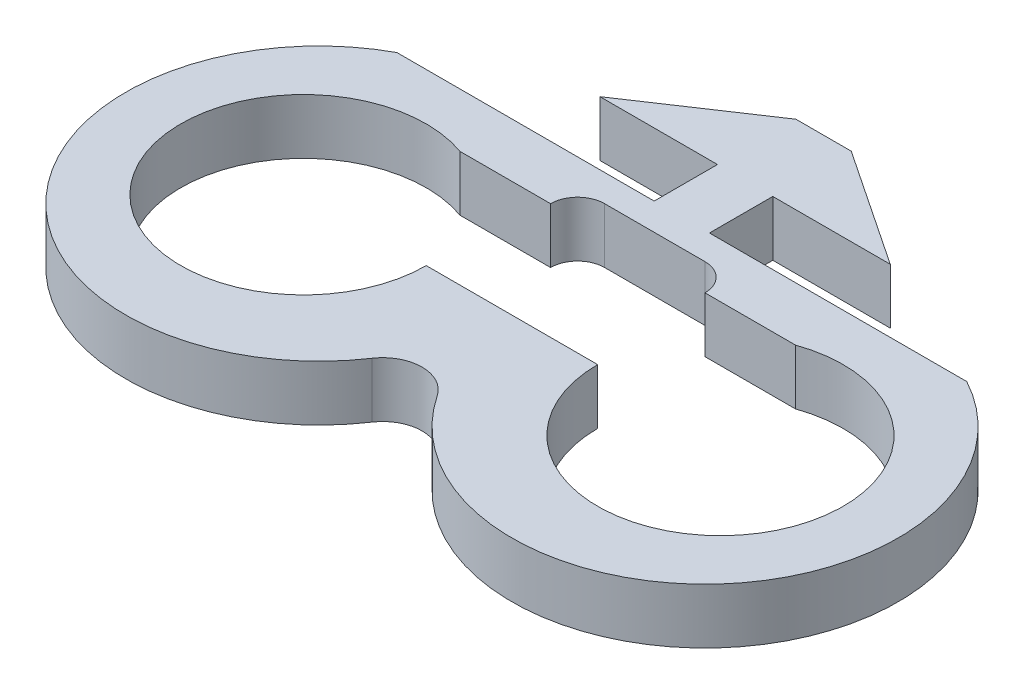
ISO-10303-21;
HEADER;
FILE_DESCRIPTION(('STEP AP214'),'2;1');
FILE_NAME('part.step','',(''),(''),'','','');
FILE_SCHEMA(('AUTOMOTIVE_DESIGN { 1 0 10303 214 1 1 1 1 }'));
ENDSEC;
DATA;
#1=APPLICATION_CONTEXT('core data for automotive mechanical design processes');
#2=APPLICATION_PROTOCOL_DEFINITION('international standard','automotive_design',2000,#1);
#3=PRODUCT_CONTEXT('',#1,'mechanical');
#4=PRODUCT('Part','Part','',(#3));
#5=PRODUCT_RELATED_PRODUCT_CATEGORY('part','',(#4));
#6=PRODUCT_DEFINITION_FORMATION('','',#4);
#7=PRODUCT_DEFINITION_CONTEXT('part definition',#1,'design');
#8=PRODUCT_DEFINITION('design','',#6,#7);
#9=PRODUCT_DEFINITION_SHAPE('','',#8);
#10=(LENGTH_UNIT() NAMED_UNIT(*) SI_UNIT(.MILLI.,.METRE.));
#11=(NAMED_UNIT(*) PLANE_ANGLE_UNIT() SI_UNIT($,.RADIAN.));
#12=(NAMED_UNIT(*) SI_UNIT($,.STERADIAN.) SOLID_ANGLE_UNIT());
#13=UNCERTAINTY_MEASURE_WITH_UNIT(LENGTH_MEASURE(1.E-05),#10,'distance_accuracy_value','');
#14=(GEOMETRIC_REPRESENTATION_CONTEXT(3) GLOBAL_UNCERTAINTY_ASSIGNED_CONTEXT((#13)) GLOBAL_UNIT_ASSIGNED_CONTEXT((#10,
#11,#12)) REPRESENTATION_CONTEXT('',''));
#15=CARTESIAN_POINT('',(0.,0.,0.));
#16=DIRECTION('',(0.,0.,1.));
#17=DIRECTION('',(1.,0.,0.));
#18=AXIS2_PLACEMENT_3D('',#15,#16,#17);
#19=CARTESIAN_POINT('',(13.5,0.,13.0482));
#20=DIRECTION('',(0.,1.,0.));
#21=DIRECTION('',(0.,0.,1.));
#22=AXIS2_PLACEMENT_3D('',#19,#20,#21);
#23=CYLINDRICAL_SURFACE('',#22,7.95);
#24=DIRECTION('',(0.,1.,0.));
#25=VECTOR('',#24,1.);
#26=CARTESIAN_POINT('',(10.8581262785667,-0.00100000000001401,5.55));
#27=LINE('',#26,#25);
#28=CARTESIAN_POINT('',(10.8581262785667,0.,5.55));
#29=VERTEX_POINT('',#28);
#30=CARTESIAN_POINT('',(10.8581262785667,3.5814,5.55));
#31=VERTEX_POINT('',#30);
#32=EDGE_CURVE('E325',#29,#31,#27,.T.);
#33=ORIENTED_EDGE('',*,*,#32,.F.);
#34=CARTESIAN_POINT('',(13.5,0.,13.0482));
#35=DIRECTION('',(0.,1.,0.));
#36=DIRECTION('',(0.,0.,1.));
#37=AXIS2_PLACEMENT_3D('',#34,#35,#36);
#38=CIRCLE('',#37,7.95);
#39=CARTESIAN_POINT('',(5.55,0.,13.0482));
#40=VERTEX_POINT('',#39);
#41=EDGE_CURVE('E303',#40,#29,#38,.T.);
#42=ORIENTED_EDGE('',*,*,#41,.F.);
#43=DIRECTION('',(0.,1.,0.));
#44=VECTOR('',#43,1.);
#45=CARTESIAN_POINT('',(5.55,-0.00100000000001401,13.0482));
#46=LINE('',#45,#44);
#47=CARTESIAN_POINT('',(5.55,3.5814,13.0482));
#48=VERTEX_POINT('',#47);
#49=EDGE_CURVE('E322',#40,#48,#46,.T.);
#50=ORIENTED_EDGE('',*,*,#49,.T.);
#51=CARTESIAN_POINT('',(13.5,3.5814,13.0482));
#52=DIRECTION('',(0.,1.,0.));
#53=DIRECTION('',(0.,0.,1.));
#54=AXIS2_PLACEMENT_3D('',#51,#52,#53);
#55=CIRCLE('',#54,7.95);
#56=EDGE_CURVE('E300',#48,#31,#55,.T.);
#57=ORIENTED_EDGE('',*,*,#56,.T.);
#58=EDGE_LOOP('',(#33,#42,#50,#57));
#59=FACE_BOUND('',#58,.T.);
#60=ADVANCED_FACE('F34',(#59),#23,.F.);
#61=CARTESIAN_POINT('',(0.,3.5814,2.05));
#62=DIRECTION('',(0.,0.,-1.));
#63=DIRECTION('',(-1.,0.,0.));
#64=AXIS2_PLACEMENT_3D('',#61,#62,#63);
#65=PLANE('',#64);
#66=DIRECTION('',(0.,1.,0.));
#67=VECTOR('',#66,1.);
#68=CARTESIAN_POINT('',(18.4502801215376,-0.00100000000001401,2.05));
#69=LINE('',#68,#67);
#70=CARTESIAN_POINT('',(18.4502801215376,0.,2.05));
#71=VERTEX_POINT('',#70);
#72=CARTESIAN_POINT('',(18.4502801215376,3.5814,2.05));
#73=VERTEX_POINT('',#72);
#74=EDGE_CURVE('E192',#71,#73,#69,.T.);
#75=ORIENTED_EDGE('',*,*,#74,.F.);
#76=DIRECTION('',(1.,0.,0.));
#77=VECTOR('',#76,1.);
#78=CARTESIAN_POINT('',(0.,0.,2.05));
#79=LINE('',#78,#77);
#80=CARTESIAN_POINT('',(1.7907,0.,2.05));
#81=VERTEX_POINT('',#80);
#82=EDGE_CURVE('E235',#81,#71,#79,.T.);
#83=ORIENTED_EDGE('',*,*,#82,.F.);
#84=DIRECTION('',(0.,-1.,0.));
#85=VECTOR('',#84,1.);
#86=CARTESIAN_POINT('',(1.7907,3.5814,2.05));
#87=LINE('',#86,#85);
#88=CARTESIAN_POINT('',(1.7907,3.5814,2.05));
#89=VERTEX_POINT('',#88);
#90=EDGE_CURVE('E11',#89,#81,#87,.T.);
#91=ORIENTED_EDGE('',*,*,#90,.F.);
#92=DIRECTION('',(1.,0.,0.));
#93=VECTOR('',#92,1.);
#94=CARTESIAN_POINT('',(0.,3.5814,2.05));
#95=LINE('',#94,#93);
#96=EDGE_CURVE('E196',#89,#73,#95,.T.);
#97=ORIENTED_EDGE('',*,*,#96,.T.);
#98=EDGE_LOOP('',(#75,#83,#91,#97));
#99=FACE_BOUND('',#98,.T.);
#100=ADVANCED_FACE('F36',(#99),#65,.T.);
#101=CARTESIAN_POINT('',(1.7907,3.5814,0.));
#102=DIRECTION('',(-1.,0.,0.));
#103=DIRECTION('',(0.,0.,1.));
#104=AXIS2_PLACEMENT_3D('',#101,#102,#103);
#105=PLANE('',#104);
#106=DIRECTION('',(0.,0.,-1.));
#107=VECTOR('',#106,1.);
#108=CARTESIAN_POINT('',(1.7907,0.,0.));
#109=LINE('',#108,#107);
#110=CARTESIAN_POINT('',(1.7907,0.,-2.05));
#111=VERTEX_POINT('',#110);
#112=EDGE_CURVE('E231',#81,#111,#109,.T.);
#113=ORIENTED_EDGE('',*,*,#112,.T.);
#114=DIRECTION('',(0.,-1.,0.));
#115=VECTOR('',#114,1.);
#116=CARTESIAN_POINT('',(1.7907,3.5814,-2.05));
#117=LINE('',#116,#115);
#118=CARTESIAN_POINT('',(1.7907,3.5814,-2.05));
#119=VERTEX_POINT('',#118);
#120=EDGE_CURVE('E42',#119,#111,#117,.T.);
#121=ORIENTED_EDGE('',*,*,#120,.F.);
#122=DIRECTION('',(0.,0.,-1.));
#123=VECTOR('',#122,1.);
#124=CARTESIAN_POINT('',(1.7907,3.5814,0.));
#125=LINE('',#124,#123);
#126=EDGE_CURVE('E200',#89,#119,#125,.T.);
#127=ORIENTED_EDGE('',*,*,#126,.F.);
#128=ORIENTED_EDGE('',*,*,#90,.T.);
#129=EDGE_LOOP('',(#113,#121,#127,#128));
#130=FACE_BOUND('',#129,.T.);
#131=ADVANCED_FACE('F232',(#130),#105,.F.);
#132=CARTESIAN_POINT('',(0.,3.5814,-2.05));
#133=DIRECTION('',(0.,0.,1.));
#134=DIRECTION('',(1.,0.,0.));
#135=AXIS2_PLACEMENT_3D('',#132,#133,#134);
#136=PLANE('',#135);
#137=DIRECTION('',(-1.,0.,0.));
#138=VECTOR('',#137,1.);
#139=CARTESIAN_POINT('',(0.,0.,-2.05));
#140=LINE('',#139,#138);
#141=CARTESIAN_POINT('',(9.398,0.,-2.05));
#142=VERTEX_POINT('',#141);
#143=EDGE_CURVE('E224',#142,#111,#140,.T.);
#144=ORIENTED_EDGE('',*,*,#143,.F.);
#145=DIRECTION('',(0.,-1.,0.));
#146=VECTOR('',#145,1.);
#147=CARTESIAN_POINT('',(9.398,3.5814,-2.05));
#148=LINE('',#147,#146);
#149=CARTESIAN_POINT('',(9.398,3.5814,-2.05));
#150=VERTEX_POINT('',#149);
#151=EDGE_CURVE('E216',#150,#142,#148,.T.);
#152=ORIENTED_EDGE('',*,*,#151,.F.);
#153=DIRECTION('',(-1.,0.,0.));
#154=VECTOR('',#153,1.);
#155=CARTESIAN_POINT('',(0.,3.5814,-2.05));
#156=LINE('',#155,#154);
#157=EDGE_CURVE('E227',#150,#119,#156,.T.);
#158=ORIENTED_EDGE('',*,*,#157,.T.);
#159=ORIENTED_EDGE('',*,*,#120,.T.);
#160=EDGE_LOOP('',(#144,#152,#158,#159));
#161=FACE_BOUND('',#160,.T.);
#162=ADVANCED_FACE('F222',(#161),#136,.T.);
#163=CARTESIAN_POINT('',(3.84513522525978,3.5814,-5.75808999982652));
#164=DIRECTION('',(0.555340809590661,0.,-0.831622862362014));
#165=DIRECTION('',(-0.831622862362014,0.,-0.555340809590661));
#166=AXIS2_PLACEMENT_3D('',#163,#164,#165);
#167=PLANE('',#166);
#168=DIRECTION('',(0.831622862362014,0.,0.555340809590661));
#169=VECTOR('',#168,1.);
#170=CARTESIAN_POINT('',(3.84513522525978,0.,-5.75808999982652));
#171=LINE('',#170,#169);
#172=CARTESIAN_POINT('',(1.7907,0.,-7.13));
#173=VERTEX_POINT('',#172);
#174=EDGE_CURVE('E239',#173,#142,#171,.T.);
#175=ORIENTED_EDGE('',*,*,#174,.F.);
#176=DIRECTION('',(0.,-1.,0.));
#177=VECTOR('',#176,1.);
#178=CARTESIAN_POINT('',(1.7907,3.5814,-7.13));
#179=LINE('',#178,#177);
#180=CARTESIAN_POINT('',(1.7907,3.5814,-7.13));
#181=VERTEX_POINT('',#180);
#182=EDGE_CURVE('E214',#181,#173,#179,.T.);
#183=ORIENTED_EDGE('',*,*,#182,.F.);
#184=DIRECTION('',(0.831622862362014,0.,0.555340809590661));
#185=VECTOR('',#184,1.);
#186=CARTESIAN_POINT('',(3.84513522525978,3.5814,-5.75808999982652));
#187=LINE('',#186,#185);
#188=EDGE_CURVE('E271',#181,#150,#187,.T.);
#189=ORIENTED_EDGE('',*,*,#188,.T.);
#190=ORIENTED_EDGE('',*,*,#151,.T.);
#191=EDGE_LOOP('',(#175,#183,#189,#190));
#192=FACE_BOUND('',#191,.T.);
#193=ADVANCED_FACE('F270',(#192),#167,.T.);
#194=CARTESIAN_POINT('',(0.,3.5814,-7.13));
#195=DIRECTION('',(0.,0.,-1.));
#196=DIRECTION('',(-1.,0.,0.));
#197=AXIS2_PLACEMENT_3D('',#194,#195,#196);
#198=PLANE('',#197);
#199=DIRECTION('',(1.,0.,0.));
#200=VECTOR('',#199,1.);
#201=CARTESIAN_POINT('',(0.,0.,-7.13));
#202=LINE('',#201,#200);
#203=CARTESIAN_POINT('',(-1.7907,0.,-7.13));
#204=VERTEX_POINT('',#203);
#205=EDGE_CURVE('E241',#204,#173,#202,.T.);
#206=ORIENTED_EDGE('',*,*,#205,.F.);
#207=DIRECTION('',(0.,-1.,0.));
#208=VECTOR('',#207,1.);
#209=CARTESIAN_POINT('',(-1.7907,3.5814,-7.13));
#210=LINE('',#209,#208);
#211=CARTESIAN_POINT('',(-1.7907,3.5814,-7.13));
#212=VERTEX_POINT('',#211);
#213=EDGE_CURVE('E212',#212,#204,#210,.T.);
#214=ORIENTED_EDGE('',*,*,#213,.F.);
#215=DIRECTION('',(1.,0.,0.));
#216=VECTOR('',#215,1.);
#217=CARTESIAN_POINT('',(0.,3.5814,-7.13));
#218=LINE('',#217,#216);
#219=EDGE_CURVE('E266',#212,#181,#218,.T.);
#220=ORIENTED_EDGE('',*,*,#219,.T.);
#221=ORIENTED_EDGE('',*,*,#182,.T.);
#222=EDGE_LOOP('',(#206,#214,#220,#221));
#223=FACE_BOUND('',#222,.T.);
#224=ADVANCED_FACE('F265',(#223),#198,.T.);
#225=CARTESIAN_POINT('',(-3.84513522525978,3.5814,-5.75808999982652));
#226=DIRECTION('',(-0.555340809590661,0.,-0.831622862362014));
#227=DIRECTION('',(-0.831622862362014,0.,0.555340809590661));
#228=AXIS2_PLACEMENT_3D('',#225,#226,#227);
#229=PLANE('',#228);
#230=DIRECTION('',(0.831622862362014,0.,-0.555340809590661));
#231=VECTOR('',#230,1.);
#232=CARTESIAN_POINT('',(-3.84513522525978,0.,-5.75808999982652));
#233=LINE('',#232,#231);
#234=CARTESIAN_POINT('',(-9.398,0.,-2.05));
#235=VERTEX_POINT('',#234);
#236=EDGE_CURVE('E246',#235,#204,#233,.T.);
#237=ORIENTED_EDGE('',*,*,#236,.F.);
#238=DIRECTION('',(0.,-1.,0.));
#239=VECTOR('',#238,1.);
#240=CARTESIAN_POINT('',(-9.398,3.5814,-2.05));
#241=LINE('',#240,#239);
#242=CARTESIAN_POINT('',(-9.398,3.5814,-2.05));
#243=VERTEX_POINT('',#242);
#244=EDGE_CURVE('E210',#243,#235,#241,.T.);
#245=ORIENTED_EDGE('',*,*,#244,.F.);
#246=DIRECTION('',(0.831622862362014,0.,-0.555340809590661));
#247=VECTOR('',#246,1.);
#248=CARTESIAN_POINT('',(-3.84513522525978,3.5814,-5.75808999982652));
#249=LINE('',#248,#247);
#250=EDGE_CURVE('E261',#243,#212,#249,.T.);
#251=ORIENTED_EDGE('',*,*,#250,.T.);
#252=ORIENTED_EDGE('',*,*,#213,.T.);
#253=EDGE_LOOP('',(#237,#245,#251,#252));
#254=FACE_BOUND('',#253,.T.);
#255=ADVANCED_FACE('F259',(#254),#229,.T.);
#256=CARTESIAN_POINT('',(0.,3.5814,-2.05));
#257=DIRECTION('',(0.,0.,1.));
#258=DIRECTION('',(1.,0.,0.));
#259=AXIS2_PLACEMENT_3D('',#256,#257,#258);
#260=PLANE('',#259);
#261=DIRECTION('',(-1.,0.,0.));
#262=VECTOR('',#261,1.);
#263=CARTESIAN_POINT('',(0.,0.,-2.05));
#264=LINE('',#263,#262);
#265=CARTESIAN_POINT('',(-1.7907,0.,-2.05));
#266=VERTEX_POINT('',#265);
#267=EDGE_CURVE('E202',#266,#235,#264,.T.);
#268=ORIENTED_EDGE('',*,*,#267,.F.);
#269=DIRECTION('',(0.,-1.,0.));
#270=VECTOR('',#269,1.);
#271=CARTESIAN_POINT('',(-1.7907,3.5814,-2.05));
#272=LINE('',#271,#270);
#273=CARTESIAN_POINT('',(-1.7907,3.5814,-2.05));
#274=VERTEX_POINT('',#273);
#275=EDGE_CURVE('E207',#274,#266,#272,.T.);
#276=ORIENTED_EDGE('',*,*,#275,.F.);
#277=DIRECTION('',(-1.,0.,0.));
#278=VECTOR('',#277,1.);
#279=CARTESIAN_POINT('',(0.,3.5814,-2.05));
#280=LINE('',#279,#278);
#281=EDGE_CURVE('E255',#274,#243,#280,.T.);
#282=ORIENTED_EDGE('',*,*,#281,.T.);
#283=ORIENTED_EDGE('',*,*,#244,.T.);
#284=EDGE_LOOP('',(#268,#276,#282,#283));
#285=FACE_BOUND('',#284,.T.);
#286=ADVANCED_FACE('F252',(#285),#260,.T.);
#287=CARTESIAN_POINT('',(-1.7907,3.5814,0.));
#288=DIRECTION('',(-1.,0.,0.));
#289=DIRECTION('',(0.,0.,1.));
#290=AXIS2_PLACEMENT_3D('',#287,#288,#289);
#291=PLANE('',#290);
#292=DIRECTION('',(0.,0.,-1.));
#293=VECTOR('',#292,1.);
#294=CARTESIAN_POINT('',(-1.7907,0.,0.));
#295=LINE('',#294,#293);
#296=CARTESIAN_POINT('',(-1.7907,0.,2.05));
#297=VERTEX_POINT('',#296);
#298=EDGE_CURVE('E197',#297,#266,#295,.T.);
#299=ORIENTED_EDGE('',*,*,#298,.F.);
#300=DIRECTION('',(0.,-1.,0.));
#301=VECTOR('',#300,1.);
#302=CARTESIAN_POINT('',(-1.7907,3.5814,2.05));
#303=LINE('',#302,#301);
#304=CARTESIAN_POINT('',(-1.7907,3.5814,2.05));
#305=VERTEX_POINT('',#304);
#306=EDGE_CURVE('E195',#305,#297,#303,.T.);
#307=ORIENTED_EDGE('',*,*,#306,.F.);
#308=DIRECTION('',(0.,0.,-1.));
#309=VECTOR('',#308,1.);
#310=CARTESIAN_POINT('',(-1.7907,3.5814,0.));
#311=LINE('',#310,#309);
#312=EDGE_CURVE('E283',#305,#274,#311,.T.);
#313=ORIENTED_EDGE('',*,*,#312,.T.);
#314=ORIENTED_EDGE('',*,*,#275,.T.);
#315=EDGE_LOOP('',(#299,#307,#313,#314));
#316=FACE_BOUND('',#315,.T.);
#317=ADVANCED_FACE('F459',(#316),#291,.T.);
#318=CARTESIAN_POINT('',(0.,3.5814,2.05));
#319=DIRECTION('',(0.,0.,1.));
#320=DIRECTION('',(1.,0.,0.));
#321=AXIS2_PLACEMENT_3D('',#318,#319,#320);
#322=PLANE('',#321);
#323=DIRECTION('',(-1.,0.,0.));
#324=VECTOR('',#323,1.);
#325=CARTESIAN_POINT('',(0.,0.,2.05));
#326=LINE('',#325,#324);
#327=CARTESIAN_POINT('',(-18.4502801215376,0.,2.05));
#328=VERTEX_POINT('',#327);
#329=EDGE_CURVE('E175',#297,#328,#326,.T.);
#330=ORIENTED_EDGE('',*,*,#329,.T.);
#331=DIRECTION('',(0.,1.,0.));
#332=VECTOR('',#331,1.);
#333=CARTESIAN_POINT('',(-18.4502801215376,-0.00100000000001401,2.05));
#334=LINE('',#333,#332);
#335=CARTESIAN_POINT('',(-18.4502801215376,3.5814,2.05));
#336=VERTEX_POINT('',#335);
#337=EDGE_CURVE('E184',#328,#336,#334,.T.);
#338=ORIENTED_EDGE('',*,*,#337,.T.);
#339=DIRECTION('',(-1.,0.,0.));
#340=VECTOR('',#339,1.);
#341=CARTESIAN_POINT('',(0.,3.5814,2.05));
#342=LINE('',#341,#340);
#343=EDGE_CURVE('E208',#305,#336,#342,.T.);
#344=ORIENTED_EDGE('',*,*,#343,.F.);
#345=ORIENTED_EDGE('',*,*,#306,.T.);
#346=EDGE_LOOP('',(#330,#338,#344,#345));
#347=FACE_BOUND('',#346,.T.);
#348=ADVANCED_FACE('F194',(#347),#322,.F.);
#349=CARTESIAN_POINT('',(0.,3.5814,0.));
#350=DIRECTION('',(0.,1.,0.));
#351=DIRECTION('',(0.,0.,1.));
#352=AXIS2_PLACEMENT_3D('',#349,#350,#351);
#353=PLANE('',#352);
#354=ORIENTED_EDGE('',*,*,#343,.T.);
#355=CARTESIAN_POINT('',(-12.50315,3.5814,13.0482));
#356=DIRECTION('',(0.,1.,0.));
#357=DIRECTION('',(0.,0.,1.));
#358=AXIS2_PLACEMENT_3D('',#355,#356,#357);
#359=CIRCLE('',#358,12.50315);
#360=CARTESIAN_POINT('',(-2.11112705783031,3.5814,20.0005103420315));
#361=VERTEX_POINT('',#360);
#362=EDGE_CURVE('E187',#336,#361,#359,.T.);
#363=ORIENTED_EDGE('',*,*,#362,.T.);
#364=CARTESIAN_POINT('',(0.,3.5814,21.4128638904382));
#365=DIRECTION('',(0.,1.,0.));
#366=DIRECTION('',(0.,0.,1.));
#367=AXIS2_PLACEMENT_3D('',#364,#365,#366);
#368=CIRCLE('',#367,2.54);
#369=CARTESIAN_POINT('',(2.11112705783031,3.5814,20.0005103420315));
#370=VERTEX_POINT('',#369);
#371=EDGE_CURVE('E296',#370,#361,#368,.T.);
#372=ORIENTED_EDGE('',*,*,#371,.F.);
#373=CARTESIAN_POINT('',(12.50315,3.5814,13.0482));
#374=DIRECTION('',(0.,1.,0.));
#375=DIRECTION('',(0.,0.,1.));
#376=AXIS2_PLACEMENT_3D('',#373,#374,#375);
#377=CIRCLE('',#376,12.50315);
#378=EDGE_CURVE('E294',#370,#73,#377,.T.);
#379=ORIENTED_EDGE('',*,*,#378,.T.);
#380=ORIENTED_EDGE('',*,*,#96,.F.);
#381=ORIENTED_EDGE('',*,*,#126,.T.);
#382=ORIENTED_EDGE('',*,*,#157,.F.);
#383=ORIENTED_EDGE('',*,*,#188,.F.);
#384=ORIENTED_EDGE('',*,*,#219,.F.);
#385=ORIENTED_EDGE('',*,*,#250,.F.);
#386=ORIENTED_EDGE('',*,*,#281,.F.);
#387=ORIENTED_EDGE('',*,*,#312,.F.);
#388=EDGE_LOOP('',(#354,#363,#372,#379,#380,#381,#382,#383,#384,#385,#386,#387));
#389=FACE_BOUND('',#388,.T.);
#390=DIRECTION('',(1.,0.,0.));
#391=VECTOR('',#390,1.);
#392=CARTESIAN_POINT('',(-5.55,3.5814,13.0482));
#393=LINE('',#392,#391);
#394=CARTESIAN_POINT('',(-5.55,3.5814,13.0482));
#395=VERTEX_POINT('',#394);
#396=EDGE_CURVE('E340',#395,#48,#393,.T.);
#397=ORIENTED_EDGE('',*,*,#396,.F.);
#398=CARTESIAN_POINT('',(-13.5,3.5814,13.0482));
#399=DIRECTION('',(0.,1.,0.));
#400=DIRECTION('',(0.,0.,1.));
#401=AXIS2_PLACEMENT_3D('',#398,#399,#400);
#402=CIRCLE('',#401,7.95);
#403=CARTESIAN_POINT('',(-10.8581262785667,3.5814,5.55));
#404=VERTEX_POINT('',#403);
#405=EDGE_CURVE('E307',#404,#395,#402,.T.);
#406=ORIENTED_EDGE('',*,*,#405,.F.);
#407=DIRECTION('',(-1.,0.,0.));
#408=VECTOR('',#407,1.);
#409=CARTESIAN_POINT('',(-5.,3.5814,5.55));
#410=LINE('',#409,#408);
#411=CARTESIAN_POINT('',(-5.,3.5814,5.55));
#412=VERTEX_POINT('',#411);
#413=EDGE_CURVE('E49',#412,#404,#410,.T.);
#414=ORIENTED_EDGE('',*,*,#413,.F.);
#415=CARTESIAN_POINT('',(-3.25,3.5814,5.55));
#416=DIRECTION('',(0.,1.,0.));
#417=DIRECTION('',(0.,0.,1.));
#418=AXIS2_PLACEMENT_3D('',#415,#416,#417);
#419=CIRCLE('',#418,1.75);
#420=CARTESIAN_POINT('',(-3.25,3.5814,3.8));
#421=VERTEX_POINT('',#420);
#422=EDGE_CURVE('E343',#421,#412,#419,.T.);
#423=ORIENTED_EDGE('',*,*,#422,.F.);
#424=DIRECTION('',(1.,0.,0.));
#425=VECTOR('',#424,1.);
#426=CARTESIAN_POINT('',(-3.25,3.5814,3.8));
#427=LINE('',#426,#425);
#428=CARTESIAN_POINT('',(3.25,3.5814,3.8));
#429=VERTEX_POINT('',#428);
#430=EDGE_CURVE('E318',#421,#429,#427,.T.);
#431=ORIENTED_EDGE('',*,*,#430,.T.);
#432=CARTESIAN_POINT('',(3.25,3.5814,5.55));
#433=DIRECTION('',(0.,1.,0.));
#434=DIRECTION('',(0.,0.,1.));
#435=AXIS2_PLACEMENT_3D('',#432,#433,#434);
#436=CIRCLE('',#435,1.75);
#437=CARTESIAN_POINT('',(5.,3.5814,5.55));
#438=VERTEX_POINT('',#437);
#439=EDGE_CURVE('E334',#438,#429,#436,.T.);
#440=ORIENTED_EDGE('',*,*,#439,.F.);
#441=DIRECTION('',(1.,0.,0.));
#442=VECTOR('',#441,1.);
#443=CARTESIAN_POINT('',(5.,3.5814,5.55));
#444=LINE('',#443,#442);
#445=EDGE_CURVE('E337',#438,#31,#444,.T.);
#446=ORIENTED_EDGE('',*,*,#445,.T.);
#447=ORIENTED_EDGE('',*,*,#56,.F.);
#448=EDGE_LOOP('',(#397,#406,#414,#423,#431,#440,#446,#447));
#449=FACE_BOUND('',#448,.T.);
#450=ADVANCED_FACE('F273',(#389,#449),#353,.T.);
#451=CARTESIAN_POINT('',(0.,0.,0.));
#452=DIRECTION('',(0.,1.,0.));
#453=DIRECTION('',(0.,0.,1.));
#454=AXIS2_PLACEMENT_3D('',#451,#452,#453);
#455=PLANE('',#454);
#456=CARTESIAN_POINT('',(-13.5,0.,13.0482));
#457=DIRECTION('',(0.,1.,0.));
#458=DIRECTION('',(0.,0.,1.));
#459=AXIS2_PLACEMENT_3D('',#456,#457,#458);
#460=CIRCLE('',#459,7.95);
#461=CARTESIAN_POINT('',(-10.8581262785667,0.,5.55));
#462=VERTEX_POINT('',#461);
#463=CARTESIAN_POINT('',(-5.55,0.,13.0482));
#464=VERTEX_POINT('',#463);
#465=EDGE_CURVE('E298',#462,#464,#460,.T.);
#466=ORIENTED_EDGE('',*,*,#465,.T.);
#467=DIRECTION('',(-1.,0.,0.));
#468=VECTOR('',#467,1.);
#469=CARTESIAN_POINT('',(-5.55,0.,13.0482));
#470=LINE('',#469,#468);
#471=EDGE_CURVE('E57',#40,#464,#470,.T.);
#472=ORIENTED_EDGE('',*,*,#471,.F.);
#473=ORIENTED_EDGE('',*,*,#41,.T.);
#474=DIRECTION('',(-1.,0.,0.));
#475=VECTOR('',#474,1.);
#476=CARTESIAN_POINT('',(5.,0.,5.55));
#477=LINE('',#476,#475);
#478=CARTESIAN_POINT('',(5.,0.,5.55));
#479=VERTEX_POINT('',#478);
#480=EDGE_CURVE('E347',#29,#479,#477,.T.);
#481=ORIENTED_EDGE('',*,*,#480,.T.);
#482=CARTESIAN_POINT('',(3.25,0.,5.55));
#483=DIRECTION('',(0.,1.,0.));
#484=DIRECTION('',(0.,0.,1.));
#485=AXIS2_PLACEMENT_3D('',#482,#483,#484);
#486=CIRCLE('',#485,1.75);
#487=CARTESIAN_POINT('',(3.25,0.,3.8));
#488=VERTEX_POINT('',#487);
#489=EDGE_CURVE('E350',#488,#479,#486,.F.);
#490=ORIENTED_EDGE('',*,*,#489,.F.);
#491=DIRECTION('',(-1.,0.,0.));
#492=VECTOR('',#491,1.);
#493=CARTESIAN_POINT('',(-3.25,0.,3.8));
#494=LINE('',#493,#492);
#495=CARTESIAN_POINT('',(-3.25,0.,3.8));
#496=VERTEX_POINT('',#495);
#497=EDGE_CURVE('E353',#488,#496,#494,.T.);
#498=ORIENTED_EDGE('',*,*,#497,.T.);
#499=CARTESIAN_POINT('',(-3.25,0.,5.55));
#500=DIRECTION('',(0.,1.,0.));
#501=DIRECTION('',(0.,0.,1.));
#502=AXIS2_PLACEMENT_3D('',#499,#500,#501);
#503=CIRCLE('',#502,1.75);
#504=CARTESIAN_POINT('',(-5.,0.,5.55));
#505=VERTEX_POINT('',#504);
#506=EDGE_CURVE('E191',#505,#496,#503,.F.);
#507=ORIENTED_EDGE('',*,*,#506,.F.);
#508=DIRECTION('',(1.,0.,0.));
#509=VECTOR('',#508,1.);
#510=CARTESIAN_POINT('',(-5.,0.,5.55));
#511=LINE('',#510,#509);
#512=EDGE_CURVE('E304',#462,#505,#511,.T.);
#513=ORIENTED_EDGE('',*,*,#512,.F.);
#514=EDGE_LOOP('',(#466,#472,#473,#481,#490,#498,#507,#513));
#515=FACE_BOUND('',#514,.T.);
#516=CARTESIAN_POINT('',(-12.50315,0.,13.0482));
#517=DIRECTION('',(0.,1.,0.));
#518=DIRECTION('',(0.,0.,1.));
#519=AXIS2_PLACEMENT_3D('',#516,#517,#518);
#520=CIRCLE('',#519,12.50315);
#521=CARTESIAN_POINT('',(-2.11112705783031,0.,20.0005103420315));
#522=VERTEX_POINT('',#521);
#523=EDGE_CURVE('E170',#522,#328,#520,.F.);
#524=ORIENTED_EDGE('',*,*,#523,.T.);
#525=ORIENTED_EDGE('',*,*,#329,.F.);
#526=ORIENTED_EDGE('',*,*,#298,.T.);
#527=ORIENTED_EDGE('',*,*,#267,.T.);
#528=ORIENTED_EDGE('',*,*,#236,.T.);
#529=ORIENTED_EDGE('',*,*,#205,.T.);
#530=ORIENTED_EDGE('',*,*,#174,.T.);
#531=ORIENTED_EDGE('',*,*,#143,.T.);
#532=ORIENTED_EDGE('',*,*,#112,.F.);
#533=ORIENTED_EDGE('',*,*,#82,.T.);
#534=CARTESIAN_POINT('',(12.50315,0.,13.0482));
#535=DIRECTION('',(0.,1.,0.));
#536=DIRECTION('',(0.,0.,1.));
#537=AXIS2_PLACEMENT_3D('',#534,#535,#536);
#538=CIRCLE('',#537,12.50315);
#539=CARTESIAN_POINT('',(2.11112705783031,0.,20.0005103420315));
#540=VERTEX_POINT('',#539);
#541=EDGE_CURVE('E286',#71,#540,#538,.F.);
#542=ORIENTED_EDGE('',*,*,#541,.T.);
#543=CARTESIAN_POINT('',(0.,0.,21.4128638904382));
#544=DIRECTION('',(0.,1.,0.));
#545=DIRECTION('',(0.,0.,1.));
#546=AXIS2_PLACEMENT_3D('',#543,#544,#545);
#547=CIRCLE('',#546,2.54);
#548=EDGE_CURVE('E178',#522,#540,#547,.F.);
#549=ORIENTED_EDGE('',*,*,#548,.F.);
#550=EDGE_LOOP('',(#524,#525,#526,#527,#528,#529,#530,#531,#532,#533,#542,#549));
#551=FACE_BOUND('',#550,.T.);
#552=ADVANCED_FACE('F172',(#515,#551),#455,.F.);
#553=CARTESIAN_POINT('',(0.,-51.5518081029415,21.4128638904382));
#554=DIRECTION('',(0.,1.,0.));
#555=DIRECTION('',(0.,0.,1.));
#556=AXIS2_PLACEMENT_3D('',#553,#554,#555);
#557=CYLINDRICAL_SURFACE('',#556,2.54);
#558=DIRECTION('',(0.,1.,0.));
#559=VECTOR('',#558,1.);
#560=CARTESIAN_POINT('',(-2.11112705783031,-51.5518081029415,20.0005103420315));
#561=LINE('',#560,#559);
#562=EDGE_CURVE('E181',#522,#361,#561,.T.);
#563=ORIENTED_EDGE('',*,*,#562,.F.);
#564=ORIENTED_EDGE('',*,*,#548,.T.);
#565=DIRECTION('',(0.,1.,0.));
#566=VECTOR('',#565,1.);
#567=CARTESIAN_POINT('',(2.11112705783031,-51.5518081029415,20.0005103420315));
#568=LINE('',#567,#566);
#569=EDGE_CURVE('E290',#540,#370,#568,.T.);
#570=ORIENTED_EDGE('',*,*,#569,.T.);
#571=ORIENTED_EDGE('',*,*,#371,.T.);
#572=EDGE_LOOP('',(#563,#564,#570,#571));
#573=FACE_BOUND('',#572,.T.);
#574=ADVANCED_FACE('F367',(#573),#557,.F.);
#575=CARTESIAN_POINT('',(-12.50315,-51.5518081029415,13.0482));
#576=DIRECTION('',(0.,1.,0.));
#577=DIRECTION('',(0.,0.,1.));
#578=AXIS2_PLACEMENT_3D('',#575,#576,#577);
#579=CYLINDRICAL_SURFACE('',#578,12.50315);
#580=ORIENTED_EDGE('',*,*,#523,.F.);
#581=ORIENTED_EDGE('',*,*,#562,.T.);
#582=ORIENTED_EDGE('',*,*,#362,.F.);
#583=ORIENTED_EDGE('',*,*,#337,.F.);
#584=EDGE_LOOP('',(#580,#581,#582,#583));
#585=FACE_BOUND('',#584,.T.);
#586=ADVANCED_FACE('F185',(#585),#579,.T.);
#587=CARTESIAN_POINT('',(12.50315,-51.5518081029415,13.0482));
#588=DIRECTION('',(0.,1.,0.));
#589=DIRECTION('',(0.,0.,1.));
#590=AXIS2_PLACEMENT_3D('',#587,#588,#589);
#591=CYLINDRICAL_SURFACE('',#590,12.50315);
#592=ORIENTED_EDGE('',*,*,#541,.F.);
#593=ORIENTED_EDGE('',*,*,#74,.T.);
#594=ORIENTED_EDGE('',*,*,#378,.F.);
#595=ORIENTED_EDGE('',*,*,#569,.F.);
#596=EDGE_LOOP('',(#592,#593,#594,#595));
#597=FACE_BOUND('',#596,.T.);
#598=ADVANCED_FACE('F362',(#597),#591,.T.);
#599=CARTESIAN_POINT('',(-13.5,0.,13.0482));
#600=DIRECTION('',(0.,1.,0.));
#601=DIRECTION('',(0.,0.,1.));
#602=AXIS2_PLACEMENT_3D('',#599,#600,#601);
#603=CYLINDRICAL_SURFACE('',#602,7.95);
#604=ORIENTED_EDGE('',*,*,#405,.T.);
#605=DIRECTION('',(0.,1.,0.));
#606=VECTOR('',#605,1.);
#607=CARTESIAN_POINT('',(-5.55,-0.00100000000001401,13.0482));
#608=LINE('',#607,#606);
#609=EDGE_CURVE('E320',#464,#395,#608,.T.);
#610=ORIENTED_EDGE('',*,*,#609,.F.);
#611=ORIENTED_EDGE('',*,*,#465,.F.);
#612=DIRECTION('',(0.,1.,0.));
#613=VECTOR('',#612,1.);
#614=CARTESIAN_POINT('',(-10.8581262785667,-0.00100000000001401,5.55));
#615=LINE('',#614,#613);
#616=EDGE_CURVE('E317',#462,#404,#615,.T.);
#617=ORIENTED_EDGE('',*,*,#616,.T.);
#618=EDGE_LOOP('',(#604,#610,#611,#617));
#619=FACE_BOUND('',#618,.T.);
#620=ADVANCED_FACE('F387',(#619),#603,.F.);
#621=CARTESIAN_POINT('',(5.,-0.00100000000001401,5.55));
#622=DIRECTION('',(0.,0.,1.));
#623=DIRECTION('',(1.,0.,0.));
#624=AXIS2_PLACEMENT_3D('',#621,#622,#623);
#625=PLANE('',#624);
#626=ORIENTED_EDGE('',*,*,#32,.T.);
#627=ORIENTED_EDGE('',*,*,#445,.F.);
#628=DIRECTION('',(0.,1.,0.));
#629=VECTOR('',#628,1.);
#630=CARTESIAN_POINT('',(5.,-0.00100000000001401,5.55));
#631=LINE('',#630,#629);
#632=EDGE_CURVE('E327',#479,#438,#631,.T.);
#633=ORIENTED_EDGE('',*,*,#632,.F.);
#634=ORIENTED_EDGE('',*,*,#480,.F.);
#635=EDGE_LOOP('',(#626,#627,#633,#634));
#636=FACE_BOUND('',#635,.T.);
#637=ADVANCED_FACE('F393',(#636),#625,.T.);
#638=CARTESIAN_POINT('',(3.25,-0.00100000000001401,5.55));
#639=DIRECTION('',(0.,1.,0.));
#640=DIRECTION('',(0.,0.,1.));
#641=AXIS2_PLACEMENT_3D('',#638,#639,#640);
#642=CYLINDRICAL_SURFACE('',#641,1.75);
#643=ORIENTED_EDGE('',*,*,#489,.T.);
#644=ORIENTED_EDGE('',*,*,#632,.T.);
#645=ORIENTED_EDGE('',*,*,#439,.T.);
#646=DIRECTION('',(0.,1.,0.));
#647=VECTOR('',#646,1.);
#648=CARTESIAN_POINT('',(3.25,-0.00100000000001401,3.8));
#649=LINE('',#648,#647);
#650=EDGE_CURVE('E329',#488,#429,#649,.T.);
#651=ORIENTED_EDGE('',*,*,#650,.F.);
#652=EDGE_LOOP('',(#643,#644,#645,#651));
#653=FACE_BOUND('',#652,.T.);
#654=ADVANCED_FACE('F398',(#653),#642,.F.);
#655=CARTESIAN_POINT('',(-3.25,-0.00100000000001401,3.8));
#656=DIRECTION('',(0.,0.,1.));
#657=DIRECTION('',(1.,0.,0.));
#658=AXIS2_PLACEMENT_3D('',#655,#656,#657);
#659=PLANE('',#658);
#660=ORIENTED_EDGE('',*,*,#650,.T.);
#661=ORIENTED_EDGE('',*,*,#430,.F.);
#662=DIRECTION('',(0.,1.,0.));
#663=VECTOR('',#662,1.);
#664=CARTESIAN_POINT('',(-3.25,-0.00100000000001401,3.8));
#665=LINE('',#664,#663);
#666=EDGE_CURVE('E314',#496,#421,#665,.T.);
#667=ORIENTED_EDGE('',*,*,#666,.F.);
#668=ORIENTED_EDGE('',*,*,#497,.F.);
#669=EDGE_LOOP('',(#660,#661,#667,#668));
#670=FACE_BOUND('',#669,.T.);
#671=ADVANCED_FACE('F417',(#670),#659,.T.);
#672=CARTESIAN_POINT('',(-5.,-0.00100000000001401,5.55));
#673=DIRECTION('',(0.,0.,-1.));
#674=DIRECTION('',(-1.,0.,0.));
#675=AXIS2_PLACEMENT_3D('',#672,#673,#674);
#676=PLANE('',#675);
#677=ORIENTED_EDGE('',*,*,#512,.T.);
#678=DIRECTION('',(0.,1.,0.));
#679=VECTOR('',#678,1.);
#680=CARTESIAN_POINT('',(-5.,-0.00100000000001401,5.55));
#681=LINE('',#680,#679);
#682=EDGE_CURVE('E315',#505,#412,#681,.T.);
#683=ORIENTED_EDGE('',*,*,#682,.T.);
#684=ORIENTED_EDGE('',*,*,#413,.T.);
#685=ORIENTED_EDGE('',*,*,#616,.F.);
#686=EDGE_LOOP('',(#677,#683,#684,#685));
#687=FACE_BOUND('',#686,.T.);
#688=ADVANCED_FACE('F411',(#687),#676,.F.);
#689=CARTESIAN_POINT('',(-3.25,-0.00100000000001401,5.55));
#690=DIRECTION('',(0.,1.,0.));
#691=DIRECTION('',(0.,0.,1.));
#692=AXIS2_PLACEMENT_3D('',#689,#690,#691);
#693=CYLINDRICAL_SURFACE('',#692,1.75);
#694=ORIENTED_EDGE('',*,*,#506,.T.);
#695=ORIENTED_EDGE('',*,*,#666,.T.);
#696=ORIENTED_EDGE('',*,*,#422,.T.);
#697=ORIENTED_EDGE('',*,*,#682,.F.);
#698=EDGE_LOOP('',(#694,#695,#696,#697));
#699=FACE_BOUND('',#698,.T.);
#700=ADVANCED_FACE('F413',(#699),#693,.F.);
#701=CARTESIAN_POINT('',(-5.55,-0.00100000000001401,13.0482));
#702=DIRECTION('',(0.,0.,1.));
#703=DIRECTION('',(1.,0.,0.));
#704=AXIS2_PLACEMENT_3D('',#701,#702,#703);
#705=PLANE('',#704);
#706=ORIENTED_EDGE('',*,*,#471,.T.);
#707=ORIENTED_EDGE('',*,*,#609,.T.);
#708=ORIENTED_EDGE('',*,*,#396,.T.);
#709=ORIENTED_EDGE('',*,*,#49,.F.);
#710=EDGE_LOOP('',(#706,#707,#708,#709));
#711=FACE_BOUND('',#710,.T.);
#712=ADVANCED_FACE('F406',(#711),#705,.F.);
#713=CLOSED_SHELL('',(#60,#100,#131,#162,#193,#224,#255,#286,#317,#348,#450,#552,#574,#586,#598,
#620,#637,#654,#671,#688,#700,#712));
#714=MANIFOLD_SOLID_BREP('B2',#713);
#715=ADVANCED_BREP_SHAPE_REPRESENTATION('',(#18,#714),#14);
#716=SHAPE_DEFINITION_REPRESENTATION(#9,#715);
ENDSEC;
END-ISO-10303-21;
